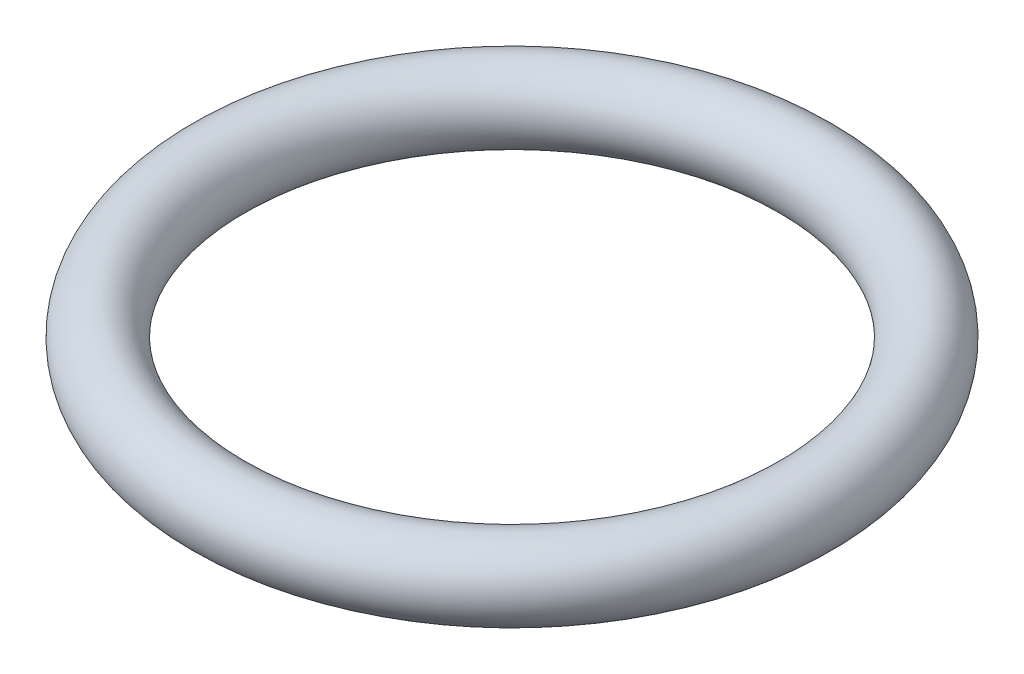
ISO-10303-21;
HEADER;
FILE_DESCRIPTION(('STEP AP214'),'2;1');
FILE_NAME('part.step','',(''),(''),'','','');
FILE_SCHEMA(('AUTOMOTIVE_DESIGN { 1 0 10303 214 1 1 1 1 }'));
ENDSEC;
DATA;
#1=APPLICATION_CONTEXT('core data for automotive mechanical design processes');
#2=APPLICATION_PROTOCOL_DEFINITION('international standard','automotive_design',2000,#1);
#3=PRODUCT_CONTEXT('',#1,'mechanical');
#4=PRODUCT('Part','Part','',(#3));
#5=PRODUCT_RELATED_PRODUCT_CATEGORY('part','',(#4));
#6=PRODUCT_DEFINITION_FORMATION('','',#4);
#7=PRODUCT_DEFINITION_CONTEXT('part definition',#1,'design');
#8=PRODUCT_DEFINITION('design','',#6,#7);
#9=PRODUCT_DEFINITION_SHAPE('','',#8);
#10=(LENGTH_UNIT() NAMED_UNIT(*) SI_UNIT(.MILLI.,.METRE.));
#11=(NAMED_UNIT(*) PLANE_ANGLE_UNIT() SI_UNIT($,.RADIAN.));
#12=(NAMED_UNIT(*) SI_UNIT($,.STERADIAN.) SOLID_ANGLE_UNIT());
#13=UNCERTAINTY_MEASURE_WITH_UNIT(LENGTH_MEASURE(1.E-05),#10,'distance_accuracy_value','');
#14=(GEOMETRIC_REPRESENTATION_CONTEXT(3) GLOBAL_UNCERTAINTY_ASSIGNED_CONTEXT((#13)) GLOBAL_UNIT_ASSIGNED_CONTEXT((#10,
#11,#12)) REPRESENTATION_CONTEXT('',''));
#15=CARTESIAN_POINT('',(0.,0.,0.));
#16=DIRECTION('',(0.,0.,1.));
#17=DIRECTION('',(1.,0.,0.));
#18=AXIS2_PLACEMENT_3D('',#15,#16,#17);
#19=CARTESIAN_POINT('',(0.,0.,0.));
#20=DIRECTION('',(0.,-1.,0.));
#21=DIRECTION('',(0.,0.,-1.));
#22=AXIS2_PLACEMENT_3D('',#19,#20,#21);
#23=TOROIDAL_SURFACE('',#22,6.35,0.79375);
#24=CARTESIAN_POINT('',(0.,0.,-7.14375));
#25=VERTEX_POINT('',#24);
#26=VERTEX_LOOP('',#25);
#27=FACE_BOUND('',#26,.T.);
#28=ADVANCED_FACE('F28',(#27),#23,.T.);
#29=CLOSED_SHELL('',(#28));
#30=MANIFOLD_SOLID_BREP('B2',#29);
#31=ADVANCED_BREP_SHAPE_REPRESENTATION('',(#18,#30),#14);
#32=SHAPE_DEFINITION_REPRESENTATION(#9,#31);
ENDSEC;
END-ISO-10303-21;
